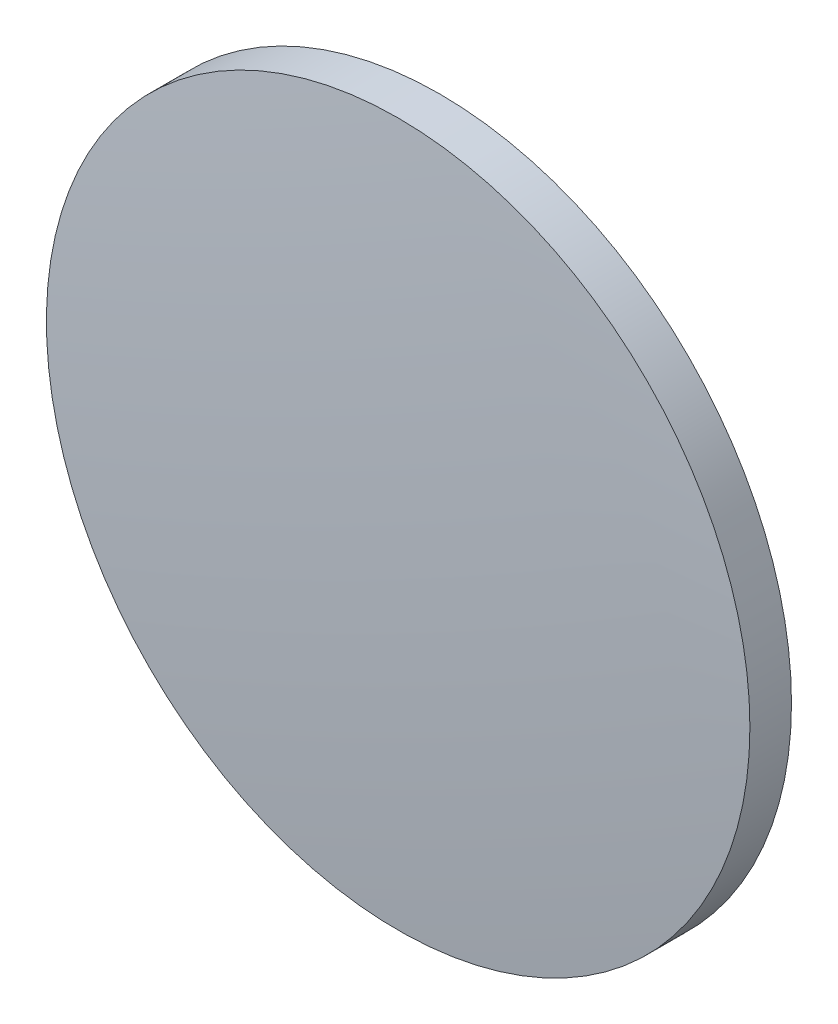
ISO-10303-21;
HEADER;
FILE_DESCRIPTION(('STEP AP214'),'2;1');
FILE_NAME('part.step','',(''),(''),'','','');
FILE_SCHEMA(('AUTOMOTIVE_DESIGN { 1 0 10303 214 1 1 1 1 }'));
ENDSEC;
DATA;
#1=APPLICATION_CONTEXT('core data for automotive mechanical design processes');
#2=APPLICATION_PROTOCOL_DEFINITION('international standard','automotive_design',2000,#1);
#3=PRODUCT_CONTEXT('',#1,'mechanical');
#4=PRODUCT('Part','Part','',(#3));
#5=PRODUCT_RELATED_PRODUCT_CATEGORY('part','',(#4));
#6=PRODUCT_DEFINITION_FORMATION('','',#4);
#7=PRODUCT_DEFINITION_CONTEXT('part definition',#1,'design');
#8=PRODUCT_DEFINITION('design','',#6,#7);
#9=PRODUCT_DEFINITION_SHAPE('','',#8);
#10=(LENGTH_UNIT() NAMED_UNIT(*) SI_UNIT(.MILLI.,.METRE.));
#11=(NAMED_UNIT(*) PLANE_ANGLE_UNIT() SI_UNIT($,.RADIAN.));
#12=(NAMED_UNIT(*) SI_UNIT($,.STERADIAN.) SOLID_ANGLE_UNIT());
#13=UNCERTAINTY_MEASURE_WITH_UNIT(LENGTH_MEASURE(1.E-05),#10,'distance_accuracy_value','');
#14=(GEOMETRIC_REPRESENTATION_CONTEXT(3) GLOBAL_UNCERTAINTY_ASSIGNED_CONTEXT((#13)) GLOBAL_UNIT_ASSIGNED_CONTEXT((#10,
#11,#12)) REPRESENTATION_CONTEXT('',''));
#15=CARTESIAN_POINT('',(0.,0.,0.));
#16=DIRECTION('',(0.,0.,1.));
#17=DIRECTION('',(1.,0.,0.));
#18=AXIS2_PLACEMENT_3D('',#15,#16,#17);
#19=CARTESIAN_POINT('',(0.,0.,305.62));
#20=DIRECTION('',(0.,0.,1.));
#21=DIRECTION('',(0.,1.,0.));
#22=AXIS2_PLACEMENT_3D('',#19,#20,#21);
#23=SPHERICAL_SURFACE('',#22,308.17);
#24=CARTESIAN_POINT('',(0.,0.,-1.50145626771171));
#25=DIRECTION('',(0.,0.,1.));
#26=DIRECTION('',(1.,0.,0.));
#27=AXIS2_PLACEMENT_3D('',#24,#25,#26);
#28=CIRCLE('',#27,25.4);
#29=CARTESIAN_POINT('',(25.4,0.,-1.50145626771171));
#30=VERTEX_POINT('',#29);
#31=EDGE_CURVE('E8',#30,#30,#28,.T.);
#32=ORIENTED_EDGE('',*,*,#31,.F.);
#33=EDGE_LOOP('',(#32));
#34=FACE_BOUND('',#33,.T.);
#35=ADVANCED_FACE('F12',(#34),#23,.T.);
#36=CARTESIAN_POINT('',(0.,0.,6.49100038893206));
#37=DIRECTION('',(0.,0.,1.));
#38=DIRECTION('',(1.,0.,0.));
#39=AXIS2_PLACEMENT_3D('',#36,#37,#38);
#40=CYLINDRICAL_SURFACE('',#39,25.4);
#41=CARTESIAN_POINT('',(0.,0.,1.50145626771175));
#42=DIRECTION('',(0.,0.,1.));
#43=DIRECTION('',(1.,0.,0.));
#44=AXIS2_PLACEMENT_3D('',#41,#42,#43);
#45=CIRCLE('',#44,25.4);
#46=CARTESIAN_POINT('',(25.4,0.,1.50145626771175));
#47=VERTEX_POINT('',#46);
#48=EDGE_CURVE('E18',#47,#47,#45,.T.);
#49=ORIENTED_EDGE('',*,*,#48,.F.);
#50=EDGE_LOOP('',(#49));
#51=FACE_BOUND('',#50,.T.);
#52=ORIENTED_EDGE('',*,*,#31,.T.);
#53=EDGE_LOOP('',(#52));
#54=FACE_BOUND('',#53,.T.);
#55=ADVANCED_FACE('F26',(#51,#54),#40,.T.);
#56=CARTESIAN_POINT('',(0.,0.,-305.62));
#57=DIRECTION('',(0.,0.,1.));
#58=DIRECTION('',(0.,1.,0.));
#59=AXIS2_PLACEMENT_3D('',#56,#57,#58);
#60=SPHERICAL_SURFACE('',#59,308.17);
#61=ORIENTED_EDGE('',*,*,#48,.T.);
#62=EDGE_LOOP('',(#61));
#63=FACE_BOUND('',#62,.T.);
#64=ADVANCED_FACE('F24',(#63),#60,.T.);
#65=CLOSED_SHELL('',(#35,#55,#64));
#66=MANIFOLD_SOLID_BREP('B1',#65);
#67=ADVANCED_BREP_SHAPE_REPRESENTATION('',(#18,#66),#14);
#68=SHAPE_DEFINITION_REPRESENTATION(#9,#67);
ENDSEC;
END-ISO-10303-21;
